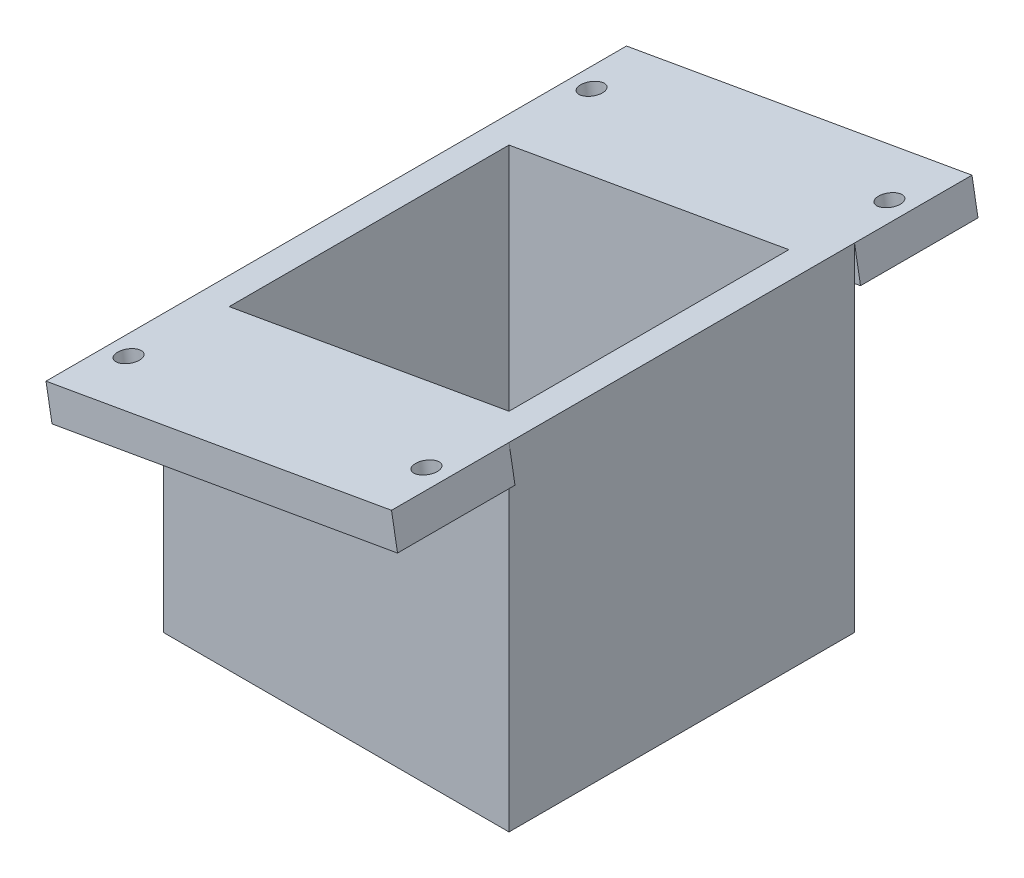
ISO-10303-21;
HEADER;
FILE_DESCRIPTION(('STEP AP214'),'2;1');
FILE_NAME('part.step','',(''),(''),'','','');
FILE_SCHEMA(('AUTOMOTIVE_DESIGN { 1 0 10303 214 1 1 1 1 }'));
ENDSEC;
DATA;
#1=APPLICATION_CONTEXT('core data for automotive mechanical design processes');
#2=APPLICATION_PROTOCOL_DEFINITION('international standard','automotive_design',2000,#1);
#3=PRODUCT_CONTEXT('',#1,'mechanical');
#4=PRODUCT('Part','Part','',(#3));
#5=PRODUCT_RELATED_PRODUCT_CATEGORY('part','',(#4));
#6=PRODUCT_DEFINITION_FORMATION('','',#4);
#7=PRODUCT_DEFINITION_CONTEXT('part definition',#1,'design');
#8=PRODUCT_DEFINITION('design','',#6,#7);
#9=PRODUCT_DEFINITION_SHAPE('','',#8);
#10=(LENGTH_UNIT() NAMED_UNIT(*) SI_UNIT(.MILLI.,.METRE.));
#11=(NAMED_UNIT(*) PLANE_ANGLE_UNIT() SI_UNIT($,.RADIAN.));
#12=(NAMED_UNIT(*) SI_UNIT($,.STERADIAN.) SOLID_ANGLE_UNIT());
#13=UNCERTAINTY_MEASURE_WITH_UNIT(LENGTH_MEASURE(1.E-05),#10,'distance_accuracy_value','');
#14=(GEOMETRIC_REPRESENTATION_CONTEXT(3) GLOBAL_UNCERTAINTY_ASSIGNED_CONTEXT((#13)) GLOBAL_UNIT_ASSIGNED_CONTEXT((#10,
#11,#12)) REPRESENTATION_CONTEXT('',''));
#15=CARTESIAN_POINT('',(0.,0.,0.));
#16=DIRECTION('',(0.,0.,1.));
#17=DIRECTION('',(1.,0.,0.));
#18=AXIS2_PLACEMENT_3D('',#15,#16,#17);
#19=CARTESIAN_POINT('',(25.,5.,-25.));
#20=DIRECTION('',(0.,0.,1.));
#21=DIRECTION('',(1.,0.,0.));
#22=AXIS2_PLACEMENT_3D('',#19,#20,#21);
#23=PLANE('',#22);
#24=DIRECTION('',(-0.17364819609251,0.984807749763281,0.));
#25=VECTOR('',#24,1.);
#26=CARTESIAN_POINT('',(-24.1317590195375,35.0759612511836,-25.));
#27=LINE('',#26,#25);
#28=CARTESIAN_POINT('',(-24.1317590195375,35.0759612511836,-25.));
#29=VERTEX_POINT('',#28);
#30=CARTESIAN_POINT('',(-25.,40.,-25.));
#31=VERTEX_POINT('',#30);
#32=EDGE_CURVE('E364',#29,#31,#27,.T.);
#33=ORIENTED_EDGE('',*,*,#32,.F.);
#34=DIRECTION('',(0.984807749763281,0.17364819609251,0.));
#35=VECTOR('',#34,1.);
#36=CARTESIAN_POINT('',(-24.1317590195375,35.0759612511836,-25.));
#37=LINE('',#36,#35);
#38=CARTESIAN_POINT('',(25.,43.7392169238216,-25.));
#39=VERTEX_POINT('',#38);
#40=EDGE_CURVE('E358',#29,#39,#37,.T.);
#41=ORIENTED_EDGE('',*,*,#40,.T.);
#42=DIRECTION('',(0.,-1.,0.));
#43=VECTOR('',#42,1.);
#44=CARTESIAN_POINT('',(25.,5.,-25.));
#45=LINE('',#44,#43);
#46=CARTESIAN_POINT('',(25.,0.,-25.));
#47=VERTEX_POINT('',#46);
#48=EDGE_CURVE('E286',#39,#47,#45,.T.);
#49=ORIENTED_EDGE('',*,*,#48,.T.);
#50=DIRECTION('',(-1.,0.,0.));
#51=VECTOR('',#50,1.);
#52=CARTESIAN_POINT('',(25.,0.,-25.));
#53=LINE('',#52,#51);
#54=CARTESIAN_POINT('',(-25.,0.,-25.));
#55=VERTEX_POINT('',#54);
#56=EDGE_CURVE('E281',#47,#55,#53,.T.);
#57=ORIENTED_EDGE('',*,*,#56,.T.);
#58=DIRECTION('',(0.,-1.,0.));
#59=VECTOR('',#58,1.);
#60=CARTESIAN_POINT('',(-25.,5.,-25.));
#61=LINE('',#60,#59);
#62=EDGE_CURVE('E283',#31,#55,#61,.T.);
#63=ORIENTED_EDGE('',*,*,#62,.F.);
#64=EDGE_LOOP('',(#33,#41,#49,#57,#63));
#65=FACE_BOUND('',#64,.T.);
#66=ADVANCED_FACE('F39',(#65),#23,.F.);
#67=CARTESIAN_POINT('',(0.,5.,0.));
#68=DIRECTION('',(0.,-1.,0.));
#69=DIRECTION('',(0.,0.,-1.));
#70=AXIS2_PLACEMENT_3D('',#67,#68,#69);
#71=PLANE('',#70);
#72=DIRECTION('',(0.,0.,-1.));
#73=VECTOR('',#72,1.);
#74=CARTESIAN_POINT('',(20.25,5.,0.));
#75=LINE('',#74,#73);
#76=CARTESIAN_POINT('',(20.25,5.,20.25));
#77=VERTEX_POINT('',#76);
#78=CARTESIAN_POINT('',(20.25,5.,-20.25));
#79=VERTEX_POINT('',#78);
#80=EDGE_CURVE('E236',#77,#79,#75,.T.);
#81=ORIENTED_EDGE('',*,*,#80,.T.);
#82=DIRECTION('',(-1.,0.,0.));
#83=VECTOR('',#82,1.);
#84=CARTESIAN_POINT('',(0.,5.,-20.25));
#85=LINE('',#84,#83);
#86=CARTESIAN_POINT('',(-20.25,5.,-20.25));
#87=VERTEX_POINT('',#86);
#88=EDGE_CURVE('E239',#79,#87,#85,.T.);
#89=ORIENTED_EDGE('',*,*,#88,.T.);
#90=DIRECTION('',(0.,0.,1.));
#91=VECTOR('',#90,1.);
#92=CARTESIAN_POINT('',(-20.25,5.,0.));
#93=LINE('',#92,#91);
#94=CARTESIAN_POINT('',(-20.25,5.,20.25));
#95=VERTEX_POINT('',#94);
#96=EDGE_CURVE('E230',#87,#95,#93,.T.);
#97=ORIENTED_EDGE('',*,*,#96,.T.);
#98=DIRECTION('',(1.,0.,0.));
#99=VECTOR('',#98,1.);
#100=CARTESIAN_POINT('',(0.,5.,20.25));
#101=LINE('',#100,#99);
#102=EDGE_CURVE('E233',#95,#77,#101,.T.);
#103=ORIENTED_EDGE('',*,*,#102,.T.);
#104=EDGE_LOOP('',(#81,#89,#97,#103));
#105=FACE_BOUND('',#104,.T.);
#106=DIRECTION('',(0.,0.,1.));
#107=VECTOR('',#106,1.);
#108=CARTESIAN_POINT('',(-18.25,5.,-18.25));
#109=LINE('',#108,#107);
#110=CARTESIAN_POINT('',(-18.25,5.,-18.25));
#111=VERTEX_POINT('',#110);
#112=CARTESIAN_POINT('',(-18.25,5.,18.25));
#113=VERTEX_POINT('',#112);
#114=EDGE_CURVE('E243',#111,#113,#109,.T.);
#115=ORIENTED_EDGE('',*,*,#114,.F.);
#116=DIRECTION('',(-1.,0.,0.));
#117=VECTOR('',#116,1.);
#118=CARTESIAN_POINT('',(18.25,5.,-18.25));
#119=LINE('',#118,#117);
#120=CARTESIAN_POINT('',(18.25,5.,-18.25));
#121=VERTEX_POINT('',#120);
#122=EDGE_CURVE('E251',#121,#111,#119,.T.);
#123=ORIENTED_EDGE('',*,*,#122,.F.);
#124=DIRECTION('',(0.,0.,-1.));
#125=VECTOR('',#124,1.);
#126=CARTESIAN_POINT('',(18.25,5.,-18.25));
#127=LINE('',#126,#125);
#128=CARTESIAN_POINT('',(18.25,5.,18.25));
#129=VERTEX_POINT('',#128);
#130=EDGE_CURVE('E248',#129,#121,#127,.T.);
#131=ORIENTED_EDGE('',*,*,#130,.F.);
#132=DIRECTION('',(1.,0.,0.));
#133=VECTOR('',#132,1.);
#134=CARTESIAN_POINT('',(18.25,5.,18.25));
#135=LINE('',#134,#133);
#136=EDGE_CURVE('E245',#113,#129,#135,.T.);
#137=ORIENTED_EDGE('',*,*,#136,.F.);
#138=EDGE_LOOP('',(#115,#123,#131,#137));
#139=FACE_BOUND('',#138,.T.);
#140=ADVANCED_FACE('F319',(#105,#139),#71,.F.);
#141=CARTESIAN_POINT('',(0.,0.,0.));
#142=DIRECTION('',(0.,-1.,0.));
#143=DIRECTION('',(0.,0.,-1.));
#144=AXIS2_PLACEMENT_3D('',#141,#142,#143);
#145=PLANE('',#144);
#146=DIRECTION('',(-1.,0.,0.));
#147=VECTOR('',#146,1.);
#148=CARTESIAN_POINT('',(18.25,0.,-18.25));
#149=LINE('',#148,#147);
#150=CARTESIAN_POINT('',(18.25,0.,-18.25));
#151=VERTEX_POINT('',#150);
#152=CARTESIAN_POINT('',(-18.25,0.,-18.25));
#153=VERTEX_POINT('',#152);
#154=EDGE_CURVE('E246',#151,#153,#149,.T.);
#155=ORIENTED_EDGE('',*,*,#154,.T.);
#156=DIRECTION('',(0.,0.,1.));
#157=VECTOR('',#156,1.);
#158=CARTESIAN_POINT('',(-18.25,0.,-18.25));
#159=LINE('',#158,#157);
#160=CARTESIAN_POINT('',(-18.25,0.,18.25));
#161=VERTEX_POINT('',#160);
#162=EDGE_CURVE('E242',#153,#161,#159,.T.);
#163=ORIENTED_EDGE('',*,*,#162,.T.);
#164=DIRECTION('',(1.,0.,0.));
#165=VECTOR('',#164,1.);
#166=CARTESIAN_POINT('',(18.25,0.,18.25));
#167=LINE('',#166,#165);
#168=CARTESIAN_POINT('',(18.25,0.,18.25));
#169=VERTEX_POINT('',#168);
#170=EDGE_CURVE('E256',#161,#169,#167,.T.);
#171=ORIENTED_EDGE('',*,*,#170,.T.);
#172=DIRECTION('',(0.,0.,-1.));
#173=VECTOR('',#172,1.);
#174=CARTESIAN_POINT('',(18.25,0.,-18.25));
#175=LINE('',#174,#173);
#176=EDGE_CURVE('E259',#169,#151,#175,.T.);
#177=ORIENTED_EDGE('',*,*,#176,.T.);
#178=EDGE_LOOP('',(#155,#163,#171,#177));
#179=FACE_BOUND('',#178,.T.);
#180=DIRECTION('',(0.,0.,1.));
#181=VECTOR('',#180,1.);
#182=CARTESIAN_POINT('',(-25.,0.,-25.));
#183=LINE('',#182,#181);
#184=CARTESIAN_POINT('',(-25.,0.,25.));
#185=VERTEX_POINT('',#184);
#186=EDGE_CURVE('E273',#55,#185,#183,.T.);
#187=ORIENTED_EDGE('',*,*,#186,.F.);
#188=ORIENTED_EDGE('',*,*,#56,.F.);
#189=DIRECTION('',(0.,0.,-1.));
#190=VECTOR('',#189,1.);
#191=CARTESIAN_POINT('',(25.,0.,-25.));
#192=LINE('',#191,#190);
#193=CARTESIAN_POINT('',(25.,0.,25.));
#194=VERTEX_POINT('',#193);
#195=EDGE_CURVE('E279',#194,#47,#192,.T.);
#196=ORIENTED_EDGE('',*,*,#195,.F.);
#197=DIRECTION('',(1.,0.,0.));
#198=VECTOR('',#197,1.);
#199=CARTESIAN_POINT('',(25.,0.,25.));
#200=LINE('',#199,#198);
#201=EDGE_CURVE('E276',#185,#194,#200,.T.);
#202=ORIENTED_EDGE('',*,*,#201,.F.);
#203=EDGE_LOOP('',(#187,#188,#196,#202));
#204=FACE_BOUND('',#203,.T.);
#205=ADVANCED_FACE('F325',(#179,#204),#145,.T.);
#206=CARTESIAN_POINT('',(-25.,5.,-25.));
#207=DIRECTION('',(1.,0.,0.));
#208=DIRECTION('',(0.,0.,-1.));
#209=AXIS2_PLACEMENT_3D('',#206,#207,#208);
#210=PLANE('',#209);
#211=ORIENTED_EDGE('',*,*,#186,.T.);
#212=DIRECTION('',(0.,-1.,0.));
#213=VECTOR('',#212,1.);
#214=CARTESIAN_POINT('',(-25.,5.,25.));
#215=LINE('',#214,#213);
#216=CARTESIAN_POINT('',(-25.,40.,25.));
#217=VERTEX_POINT('',#216);
#218=EDGE_CURVE('E48',#217,#185,#215,.T.);
#219=ORIENTED_EDGE('',*,*,#218,.F.);
#220=DIRECTION('',(0.,0.,1.));
#221=VECTOR('',#220,1.);
#222=CARTESIAN_POINT('',(-25.,40.,25.));
#223=LINE('',#222,#221);
#224=EDGE_CURVE('E212',#31,#217,#223,.T.);
#225=ORIENTED_EDGE('',*,*,#224,.F.);
#226=ORIENTED_EDGE('',*,*,#62,.T.);
#227=EDGE_LOOP('',(#211,#219,#225,#226));
#228=FACE_BOUND('',#227,.T.);
#229=ADVANCED_FACE('F41',(#228),#210,.F.);
#230=CARTESIAN_POINT('',(25.,5.,25.));
#231=DIRECTION('',(0.,0.,-1.));
#232=DIRECTION('',(-1.,0.,0.));
#233=AXIS2_PLACEMENT_3D('',#230,#231,#232);
#234=PLANE('',#233);
#235=DIRECTION('',(0.,-1.,0.));
#236=VECTOR('',#235,1.);
#237=CARTESIAN_POINT('',(25.,5.,25.));
#238=LINE('',#237,#236);
#239=CARTESIAN_POINT('',(25.,43.7392169238216,25.));
#240=VERTEX_POINT('',#239);
#241=EDGE_CURVE('E181',#240,#194,#238,.T.);
#242=ORIENTED_EDGE('',*,*,#241,.F.);
#243=DIRECTION('',(-0.984807749763281,-0.17364819609251,0.));
#244=VECTOR('',#243,1.);
#245=CARTESIAN_POINT('',(-24.1317590195375,35.0759612511836,25.));
#246=LINE('',#245,#244);
#247=CARTESIAN_POINT('',(-24.1317590195375,35.0759612511836,25.));
#248=VERTEX_POINT('',#247);
#249=EDGE_CURVE('E11',#240,#248,#246,.T.);
#250=ORIENTED_EDGE('',*,*,#249,.T.);
#251=DIRECTION('',(-0.17364819609251,0.984807749763281,0.));
#252=VECTOR('',#251,1.);
#253=CARTESIAN_POINT('',(-24.1317590195375,35.0759612511836,25.));
#254=LINE('',#253,#252);
#255=EDGE_CURVE('E745',#248,#217,#254,.T.);
#256=ORIENTED_EDGE('',*,*,#255,.T.);
#257=ORIENTED_EDGE('',*,*,#218,.T.);
#258=ORIENTED_EDGE('',*,*,#201,.T.);
#259=EDGE_LOOP('',(#242,#250,#256,#257,#258));
#260=FACE_BOUND('',#259,.T.);
#261=ADVANCED_FACE('F333',(#260),#234,.F.);
#262=CARTESIAN_POINT('',(25.,5.,-25.));
#263=DIRECTION('',(-1.,0.,0.));
#264=DIRECTION('',(0.,0.,1.));
#265=AXIS2_PLACEMENT_3D('',#262,#263,#264);
#266=PLANE('',#265);
#267=ORIENTED_EDGE('',*,*,#195,.T.);
#268=ORIENTED_EDGE('',*,*,#48,.F.);
#269=CARTESIAN_POINT('',(25.,48.81635,-25.));
#270=VERTEX_POINT('',#269);
#271=EDGE_CURVE('E207',#270,#39,#45,.T.);
#272=ORIENTED_EDGE('',*,*,#271,.F.);
#273=DIRECTION('',(0.,0.,-1.));
#274=VECTOR('',#273,1.);
#275=CARTESIAN_POINT('',(25.,48.81635,25.));
#276=LINE('',#275,#274);
#277=CARTESIAN_POINT('',(25.,48.81635,25.));
#278=VERTEX_POINT('',#277);
#279=EDGE_CURVE('E198',#278,#270,#276,.T.);
#280=ORIENTED_EDGE('',*,*,#279,.F.);
#281=EDGE_CURVE('E173',#278,#240,#238,.T.);
#282=ORIENTED_EDGE('',*,*,#281,.T.);
#283=ORIENTED_EDGE('',*,*,#241,.T.);
#284=EDGE_LOOP('',(#267,#268,#272,#280,#282,#283));
#285=FACE_BOUND('',#284,.T.);
#286=ADVANCED_FACE('F205',(#285),#266,.F.);
#287=CARTESIAN_POINT('',(-18.25,5.,-18.25));
#288=DIRECTION('',(1.,0.,0.));
#289=DIRECTION('',(0.,0.,-1.));
#290=AXIS2_PLACEMENT_3D('',#287,#288,#289);
#291=PLANE('',#290);
#292=ORIENTED_EDGE('',*,*,#162,.F.);
#293=DIRECTION('',(0.,-1.,0.));
#294=VECTOR('',#293,1.);
#295=CARTESIAN_POINT('',(-18.25,5.,-18.25));
#296=LINE('',#295,#294);
#297=EDGE_CURVE('E253',#111,#153,#296,.T.);
#298=ORIENTED_EDGE('',*,*,#297,.F.);
#299=ORIENTED_EDGE('',*,*,#114,.T.);
#300=DIRECTION('',(0.,-1.,0.));
#301=VECTOR('',#300,1.);
#302=CARTESIAN_POINT('',(-18.25,5.,18.25));
#303=LINE('',#302,#301);
#304=EDGE_CURVE('E270',#113,#161,#303,.T.);
#305=ORIENTED_EDGE('',*,*,#304,.T.);
#306=EDGE_LOOP('',(#292,#298,#299,#305));
#307=FACE_BOUND('',#306,.T.);
#308=ADVANCED_FACE('F332',(#307),#291,.T.);
#309=CARTESIAN_POINT('',(18.25,5.,18.25));
#310=DIRECTION('',(0.,0.,-1.));
#311=DIRECTION('',(-1.,0.,0.));
#312=AXIS2_PLACEMENT_3D('',#309,#310,#311);
#313=PLANE('',#312);
#314=ORIENTED_EDGE('',*,*,#170,.F.);
#315=ORIENTED_EDGE('',*,*,#304,.F.);
#316=ORIENTED_EDGE('',*,*,#136,.T.);
#317=DIRECTION('',(0.,-1.,0.));
#318=VECTOR('',#317,1.);
#319=CARTESIAN_POINT('',(18.25,5.,18.25));
#320=LINE('',#319,#318);
#321=EDGE_CURVE('E268',#129,#169,#320,.T.);
#322=ORIENTED_EDGE('',*,*,#321,.T.);
#323=EDGE_LOOP('',(#314,#315,#316,#322));
#324=FACE_BOUND('',#323,.T.);
#325=ADVANCED_FACE('F408',(#324),#313,.T.);
#326=CARTESIAN_POINT('',(18.25,5.,-18.25));
#327=DIRECTION('',(-1.,0.,0.));
#328=DIRECTION('',(0.,0.,1.));
#329=AXIS2_PLACEMENT_3D('',#326,#327,#328);
#330=PLANE('',#329);
#331=ORIENTED_EDGE('',*,*,#176,.F.);
#332=ORIENTED_EDGE('',*,*,#321,.F.);
#333=ORIENTED_EDGE('',*,*,#130,.T.);
#334=DIRECTION('',(0.,-1.,0.));
#335=VECTOR('',#334,1.);
#336=CARTESIAN_POINT('',(18.25,5.,-18.25));
#337=LINE('',#336,#335);
#338=EDGE_CURVE('E266',#121,#151,#337,.T.);
#339=ORIENTED_EDGE('',*,*,#338,.T.);
#340=EDGE_LOOP('',(#331,#332,#333,#339));
#341=FACE_BOUND('',#340,.T.);
#342=ADVANCED_FACE('F404',(#341),#330,.T.);
#343=CARTESIAN_POINT('',(18.25,5.,-18.25));
#344=DIRECTION('',(0.,0.,1.));
#345=DIRECTION('',(1.,0.,0.));
#346=AXIS2_PLACEMENT_3D('',#343,#344,#345);
#347=PLANE('',#346);
#348=ORIENTED_EDGE('',*,*,#154,.F.);
#349=ORIENTED_EDGE('',*,*,#338,.F.);
#350=ORIENTED_EDGE('',*,*,#122,.T.);
#351=ORIENTED_EDGE('',*,*,#297,.T.);
#352=EDGE_LOOP('',(#348,#349,#350,#351));
#353=FACE_BOUND('',#352,.T.);
#354=ADVANCED_FACE('F396',(#353),#347,.T.);
#355=CARTESIAN_POINT('',(20.25,110.710678118655,-20.25));
#356=DIRECTION('',(0.,0.,1.));
#357=DIRECTION('',(1.,0.,0.));
#358=AXIS2_PLACEMENT_3D('',#355,#356,#357);
#359=PLANE('',#358);
#360=ORIENTED_EDGE('',*,*,#88,.F.);
#361=DIRECTION('',(0.,-1.,0.));
#362=VECTOR('',#361,1.);
#363=CARTESIAN_POINT('',(20.25,110.710678118655,-20.25));
#364=LINE('',#363,#362);
#365=CARTESIAN_POINT('',(20.25,47.97879675,-20.25));
#366=VERTEX_POINT('',#365);
#367=EDGE_CURVE('E223',#366,#79,#364,.T.);
#368=ORIENTED_EDGE('',*,*,#367,.F.);
#369=DIRECTION('',(-0.984807749763281,-0.17364819609251,0.));
#370=VECTOR('',#369,1.);
#371=CARTESIAN_POINT('',(31.8248981935647,50.0197638237767,-20.25));
#372=LINE('',#371,#370);
#373=CARTESIAN_POINT('',(-20.25,40.83755325,-20.25));
#374=VERTEX_POINT('',#373);
#375=EDGE_CURVE('E208',#366,#374,#372,.T.);
#376=ORIENTED_EDGE('',*,*,#375,.T.);
#377=DIRECTION('',(0.,-1.,0.));
#378=VECTOR('',#377,1.);
#379=CARTESIAN_POINT('',(-20.25,110.710678118655,-20.25));
#380=LINE('',#379,#378);
#381=EDGE_CURVE('E220',#374,#87,#380,.T.);
#382=ORIENTED_EDGE('',*,*,#381,.T.);
#383=EDGE_LOOP('',(#360,#368,#376,#382));
#384=FACE_BOUND('',#383,.T.);
#385=ADVANCED_FACE('F385',(#384),#359,.T.);
#386=CARTESIAN_POINT('',(20.25,110.710678118655,20.25));
#387=DIRECTION('',(-1.,0.,0.));
#388=DIRECTION('',(0.,0.,1.));
#389=AXIS2_PLACEMENT_3D('',#386,#387,#388);
#390=PLANE('',#389);
#391=ORIENTED_EDGE('',*,*,#80,.F.);
#392=DIRECTION('',(0.,-1.,0.));
#393=VECTOR('',#392,1.);
#394=CARTESIAN_POINT('',(20.25,110.710678118655,20.25));
#395=LINE('',#394,#393);
#396=CARTESIAN_POINT('',(20.25,47.97879675,20.25));
#397=VERTEX_POINT('',#396);
#398=EDGE_CURVE('E226',#397,#77,#395,.T.);
#399=ORIENTED_EDGE('',*,*,#398,.F.);
#400=DIRECTION('',(0.,0.,-1.));
#401=VECTOR('',#400,1.);
#402=CARTESIAN_POINT('',(20.25,47.97879675,20.25));
#403=LINE('',#402,#401);
#404=EDGE_CURVE('E366',#397,#366,#403,.T.);
#405=ORIENTED_EDGE('',*,*,#404,.T.);
#406=ORIENTED_EDGE('',*,*,#367,.T.);
#407=EDGE_LOOP('',(#391,#399,#405,#406));
#408=FACE_BOUND('',#407,.T.);
#409=ADVANCED_FACE('F388',(#408),#390,.T.);
#410=CARTESIAN_POINT('',(20.25,110.710678118655,20.25));
#411=DIRECTION('',(0.,0.,-1.));
#412=DIRECTION('',(-1.,0.,0.));
#413=AXIS2_PLACEMENT_3D('',#410,#411,#412);
#414=PLANE('',#413);
#415=ORIENTED_EDGE('',*,*,#102,.F.);
#416=DIRECTION('',(0.,-1.,0.));
#417=VECTOR('',#416,1.);
#418=CARTESIAN_POINT('',(-20.25,110.710678118655,20.25));
#419=LINE('',#418,#417);
#420=CARTESIAN_POINT('',(-20.25,40.83755325,20.25));
#421=VERTEX_POINT('',#420);
#422=EDGE_CURVE('E65',#421,#95,#419,.T.);
#423=ORIENTED_EDGE('',*,*,#422,.F.);
#424=DIRECTION('',(0.984807749763281,0.17364819609251,0.));
#425=VECTOR('',#424,1.);
#426=CARTESIAN_POINT('',(31.8248981935647,50.0197638237767,20.25));
#427=LINE('',#426,#425);
#428=EDGE_CURVE('E214',#421,#397,#427,.T.);
#429=ORIENTED_EDGE('',*,*,#428,.T.);
#430=ORIENTED_EDGE('',*,*,#398,.T.);
#431=EDGE_LOOP('',(#415,#423,#429,#430));
#432=FACE_BOUND('',#431,.T.);
#433=ADVANCED_FACE('F378',(#432),#414,.T.);
#434=CARTESIAN_POINT('',(-20.25,110.710678118655,20.25));
#435=DIRECTION('',(1.,0.,0.));
#436=DIRECTION('',(0.,0.,-1.));
#437=AXIS2_PLACEMENT_3D('',#434,#435,#436);
#438=PLANE('',#437);
#439=ORIENTED_EDGE('',*,*,#96,.F.);
#440=ORIENTED_EDGE('',*,*,#381,.F.);
#441=DIRECTION('',(0.,0.,1.));
#442=VECTOR('',#441,1.);
#443=CARTESIAN_POINT('',(-20.25,40.83755325,20.25));
#444=LINE('',#443,#442);
#445=EDGE_CURVE('E209',#374,#421,#444,.T.);
#446=ORIENTED_EDGE('',*,*,#445,.T.);
#447=ORIENTED_EDGE('',*,*,#422,.T.);
#448=EDGE_LOOP('',(#439,#440,#446,#447));
#449=FACE_BOUND('',#448,.T.);
#450=ADVANCED_FACE('F383',(#449),#438,.T.);
#451=CARTESIAN_POINT('',(-7.59424596992729,43.0691043908606,0.));
#452=DIRECTION('',(-0.17364819609251,0.984807749763281,0.));
#453=DIRECTION('',(-0.984807749763281,-0.17364819609251,0.));
#454=AXIS2_PLACEMENT_3D('',#451,#452,#453);
#455=PLANE('',#454);
#456=CARTESIAN_POINT('',(-21.5531728758285,40.6077686863238,-33.5));
#457=DIRECTION('',(-0.17364819609251,0.984807749763281,0.));
#458=DIRECTION('',(0.984807749763281,0.17364819609251,0.));
#459=AXIS2_PLACEMENT_3D('',#456,#457,#458);
#460=CIRCLE('',#459,1.60000000000001);
#461=CARTESIAN_POINT('',(-19.9774804762073,40.8856058000718,-33.5));
#462=VERTEX_POINT('',#461);
#463=EDGE_CURVE('E741',#462,#462,#460,.T.);
#464=ORIENTED_EDGE('',*,*,#463,.F.);
#465=EDGE_LOOP('',(#464));
#466=FACE_BOUND('',#465,.T.);
#467=CARTESIAN_POINT('',(21.5531728758285,48.2085813136762,-33.5));
#468=DIRECTION('',(-0.17364819609251,0.984807749763281,0.));
#469=DIRECTION('',(-0.984807749763281,-0.17364819609251,0.));
#470=AXIS2_PLACEMENT_3D('',#467,#468,#469);
#471=CIRCLE('',#470,1.6);
#472=CARTESIAN_POINT('',(19.9774804762072,47.9307441999282,-33.5));
#473=VERTEX_POINT('',#472);
#474=EDGE_CURVE('E736',#473,#473,#471,.T.);
#475=ORIENTED_EDGE('',*,*,#474,.F.);
#476=EDGE_LOOP('',(#475));
#477=FACE_BOUND('',#476,.T.);
#478=CARTESIAN_POINT('',(21.5531728758285,48.2085813136762,33.5));
#479=DIRECTION('',(-0.17364819609251,0.984807749763281,0.));
#480=DIRECTION('',(0.984807749763281,0.17364819609251,0.));
#481=AXIS2_PLACEMENT_3D('',#478,#479,#480);
#482=CIRCLE('',#481,1.6);
#483=CARTESIAN_POINT('',(23.1288652754498,48.4864184274242,33.5));
#484=VERTEX_POINT('',#483);
#485=EDGE_CURVE('E734',#484,#484,#482,.T.);
#486=ORIENTED_EDGE('',*,*,#485,.F.);
#487=EDGE_LOOP('',(#486));
#488=FACE_BOUND('',#487,.T.);
#489=CARTESIAN_POINT('',(-21.5531728758285,40.6077686863238,33.5));
#490=DIRECTION('',(-0.17364819609251,0.984807749763281,0.));
#491=DIRECTION('',(-0.984807749763281,-0.17364819609251,0.));
#492=AXIS2_PLACEMENT_3D('',#489,#490,#491);
#493=CIRCLE('',#492,1.60000000000001);
#494=CARTESIAN_POINT('',(-23.1288652754498,40.3299315725758,33.5));
#495=VERTEX_POINT('',#494);
#496=EDGE_CURVE('E294',#495,#495,#493,.T.);
#497=ORIENTED_EDGE('',*,*,#496,.F.);
#498=EDGE_LOOP('',(#497));
#499=FACE_BOUND('',#498,.T.);
#500=ORIENTED_EDGE('',*,*,#445,.F.);
#501=ORIENTED_EDGE('',*,*,#375,.F.);
#502=ORIENTED_EDGE('',*,*,#404,.F.);
#503=ORIENTED_EDGE('',*,*,#428,.F.);
#504=EDGE_LOOP('',(#500,#501,#502,#503));
#505=FACE_BOUND('',#504,.T.);
#506=ORIENTED_EDGE('',*,*,#279,.T.);
#507=DIRECTION('',(0.,0.,-1.));
#508=VECTOR('',#507,1.);
#509=CARTESIAN_POINT('',(25.,48.81635,-25.));
#510=LINE('',#509,#508);
#511=CARTESIAN_POINT('',(25.,48.81635,-42.));
#512=VERTEX_POINT('',#511);
#513=EDGE_CURVE('E360',#270,#512,#510,.T.);
#514=ORIENTED_EDGE('',*,*,#513,.T.);
#515=DIRECTION('',(-0.984807749763281,-0.17364819609251,0.));
#516=VECTOR('',#515,1.);
#517=CARTESIAN_POINT('',(-25.,40.,-42.));
#518=LINE('',#517,#516);
#519=CARTESIAN_POINT('',(-25.,40.,-42.));
#520=VERTEX_POINT('',#519);
#521=EDGE_CURVE('E355',#512,#520,#518,.T.);
#522=ORIENTED_EDGE('',*,*,#521,.T.);
#523=DIRECTION('',(0.,0.,1.));
#524=VECTOR('',#523,1.);
#525=CARTESIAN_POINT('',(-25.,40.,-25.));
#526=LINE('',#525,#524);
#527=EDGE_CURVE('E353',#520,#31,#526,.T.);
#528=ORIENTED_EDGE('',*,*,#527,.T.);
#529=ORIENTED_EDGE('',*,*,#224,.T.);
#530=DIRECTION('',(0.,0.,1.));
#531=VECTOR('',#530,1.);
#532=CARTESIAN_POINT('',(-25.,40.,25.));
#533=LINE('',#532,#531);
#534=CARTESIAN_POINT('',(-25.,40.,42.));
#535=VERTEX_POINT('',#534);
#536=EDGE_CURVE('E350',#217,#535,#533,.T.);
#537=ORIENTED_EDGE('',*,*,#536,.T.);
#538=DIRECTION('',(0.984807749763281,0.17364819609251,0.));
#539=VECTOR('',#538,1.);
#540=CARTESIAN_POINT('',(-25.,40.,42.));
#541=LINE('',#540,#539);
#542=CARTESIAN_POINT('',(25.,48.81635,42.));
#543=VERTEX_POINT('',#542);
#544=EDGE_CURVE('E201',#535,#543,#541,.T.);
#545=ORIENTED_EDGE('',*,*,#544,.T.);
#546=DIRECTION('',(0.,0.,-1.));
#547=VECTOR('',#546,1.);
#548=CARTESIAN_POINT('',(25.,48.81635,25.));
#549=LINE('',#548,#547);
#550=EDGE_CURVE('E188',#543,#278,#549,.T.);
#551=ORIENTED_EDGE('',*,*,#550,.T.);
#552=EDGE_LOOP('',(#506,#514,#522,#528,#529,#537,#545,#551));
#553=FACE_BOUND('',#552,.T.);
#554=ADVANCED_FACE('F196',(#466,#477,#488,#499,#505,#553),#455,.T.);
#555=CARTESIAN_POINT('',(-24.1317590195375,35.0759612511836,-25.));
#556=DIRECTION('',(0.,0.,1.));
#557=DIRECTION('',(1.,0.,0.));
#558=AXIS2_PLACEMENT_3D('',#555,#556,#557);
#559=PLANE('',#558);
#560=DIRECTION('',(-0.17364819609251,0.984807749763281,0.));
#561=VECTOR('',#560,1.);
#562=CARTESIAN_POINT('',(25.8682409804625,43.8923112511836,-25.));
#563=LINE('',#562,#561);
#564=CARTESIAN_POINT('',(25.8682409804625,43.8923112511836,-25.));
#565=VERTEX_POINT('',#564);
#566=EDGE_CURVE('E371',#565,#270,#563,.T.);
#567=ORIENTED_EDGE('',*,*,#566,.T.);
#568=ORIENTED_EDGE('',*,*,#271,.T.);
#569=EDGE_CURVE('E57',#39,#565,#37,.T.);
#570=ORIENTED_EDGE('',*,*,#569,.T.);
#571=EDGE_LOOP('',(#567,#568,#570));
#572=FACE_BOUND('',#571,.T.);
#573=ADVANCED_FACE('F461',(#572),#559,.T.);
#574=CARTESIAN_POINT('',(-24.1317590195375,35.0759612511836,-25.));
#575=DIRECTION('',(-0.984807749763281,-0.17364819609251,0.));
#576=DIRECTION('',(0.17364819609251,-0.984807749763281,0.));
#577=AXIS2_PLACEMENT_3D('',#574,#575,#576);
#578=PLANE('',#577);
#579=ORIENTED_EDGE('',*,*,#527,.F.);
#580=DIRECTION('',(-0.17364819609251,0.984807749763281,0.));
#581=VECTOR('',#580,1.);
#582=CARTESIAN_POINT('',(-24.1317590195375,35.0759612511836,-42.));
#583=LINE('',#582,#581);
#584=CARTESIAN_POINT('',(-24.1317590195375,35.0759612511836,-42.));
#585=VERTEX_POINT('',#584);
#586=EDGE_CURVE('E367',#585,#520,#583,.T.);
#587=ORIENTED_EDGE('',*,*,#586,.F.);
#588=DIRECTION('',(0.,0.,1.));
#589=VECTOR('',#588,1.);
#590=CARTESIAN_POINT('',(-24.1317590195375,35.0759612511836,-25.));
#591=LINE('',#590,#589);
#592=EDGE_CURVE('E373',#585,#29,#591,.T.);
#593=ORIENTED_EDGE('',*,*,#592,.T.);
#594=ORIENTED_EDGE('',*,*,#32,.T.);
#595=EDGE_LOOP('',(#579,#587,#593,#594));
#596=FACE_BOUND('',#595,.T.);
#597=ADVANCED_FACE('F466',(#596),#578,.T.);
#598=CARTESIAN_POINT('',(-24.1317590195375,35.0759612511836,-42.));
#599=DIRECTION('',(0.,0.,-1.));
#600=DIRECTION('',(0.,1.,0.));
#601=AXIS2_PLACEMENT_3D('',#598,#599,#600);
#602=PLANE('',#601);
#603=ORIENTED_EDGE('',*,*,#521,.F.);
#604=DIRECTION('',(-0.17364819609251,0.984807749763281,0.));
#605=VECTOR('',#604,1.);
#606=CARTESIAN_POINT('',(25.8682409804625,43.8923112511836,-42.));
#607=LINE('',#606,#605);
#608=CARTESIAN_POINT('',(25.8682409804625,43.8923112511836,-42.));
#609=VERTEX_POINT('',#608);
#610=EDGE_CURVE('E369',#609,#512,#607,.T.);
#611=ORIENTED_EDGE('',*,*,#610,.F.);
#612=DIRECTION('',(-0.984807749763281,-0.17364819609251,0.));
#613=VECTOR('',#612,1.);
#614=CARTESIAN_POINT('',(-24.1317590195375,35.0759612511836,-42.));
#615=LINE('',#614,#613);
#616=EDGE_CURVE('E762',#609,#585,#615,.T.);
#617=ORIENTED_EDGE('',*,*,#616,.T.);
#618=ORIENTED_EDGE('',*,*,#586,.T.);
#619=EDGE_LOOP('',(#603,#611,#617,#618));
#620=FACE_BOUND('',#619,.T.);
#621=ADVANCED_FACE('F479',(#620),#602,.T.);
#622=CARTESIAN_POINT('',(25.8682409804625,43.8923112511836,-25.));
#623=DIRECTION('',(0.984807749763281,0.17364819609251,0.));
#624=DIRECTION('',(-0.17364819609251,0.984807749763281,0.));
#625=AXIS2_PLACEMENT_3D('',#622,#623,#624);
#626=PLANE('',#625);
#627=ORIENTED_EDGE('',*,*,#513,.F.);
#628=ORIENTED_EDGE('',*,*,#566,.F.);
#629=DIRECTION('',(0.,0.,-1.));
#630=VECTOR('',#629,1.);
#631=CARTESIAN_POINT('',(25.8682409804625,43.8923112511836,-25.));
#632=LINE('',#631,#630);
#633=EDGE_CURVE('E759',#565,#609,#632,.T.);
#634=ORIENTED_EDGE('',*,*,#633,.T.);
#635=ORIENTED_EDGE('',*,*,#610,.T.);
#636=EDGE_LOOP('',(#627,#628,#634,#635));
#637=FACE_BOUND('',#636,.T.);
#638=ADVANCED_FACE('F489',(#637),#626,.T.);
#639=CARTESIAN_POINT('',(-6.72600498946474,38.1450656420443,0.));
#640=DIRECTION('',(-0.17364819609251,0.984807749763281,0.));
#641=DIRECTION('',(-0.984807749763281,-0.17364819609251,0.));
#642=AXIS2_PLACEMENT_3D('',#639,#640,#641);
#643=PLANE('',#642);
#644=CARTESIAN_POINT('',(-20.684931895366,35.6837299375074,-33.5));
#645=DIRECTION('',(-0.17364819609251,0.984807749763281,0.));
#646=DIRECTION('',(-0.984807749763281,-0.17364819609251,0.));
#647=AXIS2_PLACEMENT_3D('',#644,#645,#646);
#648=CIRCLE('',#647,1.60000000000001);
#649=CARTESIAN_POINT('',(-22.2606242949872,35.4058928237594,-33.5));
#650=VERTEX_POINT('',#649);
#651=EDGE_CURVE('E43',#650,#650,#648,.T.);
#652=ORIENTED_EDGE('',*,*,#651,.T.);
#653=EDGE_LOOP('',(#652));
#654=FACE_BOUND('',#653,.T.);
#655=CARTESIAN_POINT('',(22.421413856291,43.2845425648598,-33.5));
#656=DIRECTION('',(-0.17364819609251,0.984807749763281,0.));
#657=DIRECTION('',(-0.984807749763281,-0.17364819609251,0.));
#658=AXIS2_PLACEMENT_3D('',#655,#656,#657);
#659=CIRCLE('',#658,1.6);
#660=CARTESIAN_POINT('',(20.8457214566698,43.0067054511118,-33.5));
#661=VERTEX_POINT('',#660);
#662=EDGE_CURVE('E296',#661,#661,#659,.T.);
#663=ORIENTED_EDGE('',*,*,#662,.T.);
#664=EDGE_LOOP('',(#663));
#665=FACE_BOUND('',#664,.T.);
#666=ORIENTED_EDGE('',*,*,#40,.F.);
#667=ORIENTED_EDGE('',*,*,#592,.F.);
#668=ORIENTED_EDGE('',*,*,#616,.F.);
#669=ORIENTED_EDGE('',*,*,#633,.F.);
#670=ORIENTED_EDGE('',*,*,#569,.F.);
#671=EDGE_LOOP('',(#666,#667,#668,#669,#670));
#672=FACE_BOUND('',#671,.T.);
#673=ADVANCED_FACE('F303',(#654,#665,#672),#643,.F.);
#674=CARTESIAN_POINT('',(-24.1317590195375,35.0759612511836,25.));
#675=DIRECTION('',(0.,0.,-1.));
#676=DIRECTION('',(0.,1.,0.));
#677=AXIS2_PLACEMENT_3D('',#674,#675,#676);
#678=PLANE('',#677);
#679=ORIENTED_EDGE('',*,*,#281,.F.);
#680=DIRECTION('',(-0.17364819609251,0.984807749763281,0.));
#681=VECTOR('',#680,1.);
#682=CARTESIAN_POINT('',(25.8682409804625,43.8923112511836,25.));
#683=LINE('',#682,#681);
#684=CARTESIAN_POINT('',(25.8682409804625,43.8923112511836,25.));
#685=VERTEX_POINT('',#684);
#686=EDGE_CURVE('E176',#685,#278,#683,.T.);
#687=ORIENTED_EDGE('',*,*,#686,.F.);
#688=EDGE_CURVE('E50',#685,#240,#246,.T.);
#689=ORIENTED_EDGE('',*,*,#688,.T.);
#690=EDGE_LOOP('',(#679,#687,#689));
#691=FACE_BOUND('',#690,.T.);
#692=ADVANCED_FACE('F175',(#691),#678,.T.);
#693=CARTESIAN_POINT('',(25.8682409804625,43.8923112511836,25.));
#694=DIRECTION('',(0.984807749763281,0.17364819609251,0.));
#695=DIRECTION('',(-0.17364819609251,0.984807749763281,0.));
#696=AXIS2_PLACEMENT_3D('',#693,#694,#695);
#697=PLANE('',#696);
#698=ORIENTED_EDGE('',*,*,#550,.F.);
#699=DIRECTION('',(-0.17364819609251,0.984807749763281,0.));
#700=VECTOR('',#699,1.);
#701=CARTESIAN_POINT('',(25.8682409804625,43.8923112511836,42.));
#702=LINE('',#701,#700);
#703=CARTESIAN_POINT('',(25.8682409804625,43.8923112511836,42.));
#704=VERTEX_POINT('',#703);
#705=EDGE_CURVE('E191',#704,#543,#702,.T.);
#706=ORIENTED_EDGE('',*,*,#705,.F.);
#707=DIRECTION('',(0.,0.,-1.));
#708=VECTOR('',#707,1.);
#709=CARTESIAN_POINT('',(25.8682409804625,43.8923112511836,25.));
#710=LINE('',#709,#708);
#711=EDGE_CURVE('E190',#704,#685,#710,.T.);
#712=ORIENTED_EDGE('',*,*,#711,.T.);
#713=ORIENTED_EDGE('',*,*,#686,.T.);
#714=EDGE_LOOP('',(#698,#706,#712,#713));
#715=FACE_BOUND('',#714,.T.);
#716=ADVANCED_FACE('F187',(#715),#697,.T.);
#717=CARTESIAN_POINT('',(-24.1317590195375,35.0759612511836,42.));
#718=DIRECTION('',(0.,0.,1.));
#719=DIRECTION('',(0.,-1.,0.));
#720=AXIS2_PLACEMENT_3D('',#717,#718,#719);
#721=PLANE('',#720);
#722=ORIENTED_EDGE('',*,*,#544,.F.);
#723=DIRECTION('',(-0.17364819609251,0.984807749763281,0.));
#724=VECTOR('',#723,1.);
#725=CARTESIAN_POINT('',(-24.1317590195375,35.0759612511836,42.));
#726=LINE('',#725,#724);
#727=CARTESIAN_POINT('',(-24.1317590195375,35.0759612511836,42.));
#728=VERTEX_POINT('',#727);
#729=EDGE_CURVE('E747',#728,#535,#726,.T.);
#730=ORIENTED_EDGE('',*,*,#729,.F.);
#731=DIRECTION('',(0.984807749763281,0.17364819609251,0.));
#732=VECTOR('',#731,1.);
#733=CARTESIAN_POINT('',(-24.1317590195375,35.0759612511836,42.));
#734=LINE('',#733,#732);
#735=EDGE_CURVE('E753',#728,#704,#734,.T.);
#736=ORIENTED_EDGE('',*,*,#735,.T.);
#737=ORIENTED_EDGE('',*,*,#705,.T.);
#738=EDGE_LOOP('',(#722,#730,#736,#737));
#739=FACE_BOUND('',#738,.T.);
#740=ADVANCED_FACE('F521',(#739),#721,.T.);
#741=CARTESIAN_POINT('',(-24.1317590195375,35.0759612511836,25.));
#742=DIRECTION('',(-0.984807749763281,-0.17364819609251,0.));
#743=DIRECTION('',(0.17364819609251,-0.984807749763281,0.));
#744=AXIS2_PLACEMENT_3D('',#741,#742,#743);
#745=PLANE('',#744);
#746=ORIENTED_EDGE('',*,*,#536,.F.);
#747=ORIENTED_EDGE('',*,*,#255,.F.);
#748=DIRECTION('',(0.,0.,1.));
#749=VECTOR('',#748,1.);
#750=CARTESIAN_POINT('',(-24.1317590195375,35.0759612511836,25.));
#751=LINE('',#750,#749);
#752=EDGE_CURVE('E756',#248,#728,#751,.T.);
#753=ORIENTED_EDGE('',*,*,#752,.T.);
#754=ORIENTED_EDGE('',*,*,#729,.T.);
#755=EDGE_LOOP('',(#746,#747,#753,#754));
#756=FACE_BOUND('',#755,.T.);
#757=ADVANCED_FACE('F531',(#756),#745,.T.);
#758=CARTESIAN_POINT('',(-6.72600498946474,38.1450656420442,0.));
#759=DIRECTION('',(0.17364819609251,-0.984807749763281,0.));
#760=DIRECTION('',(0.984807749763281,0.17364819609251,0.));
#761=AXIS2_PLACEMENT_3D('',#758,#759,#760);
#762=PLANE('',#761);
#763=CARTESIAN_POINT('',(22.421413856291,43.2845425648598,33.5));
#764=DIRECTION('',(0.17364819609251,-0.984807749763281,0.));
#765=DIRECTION('',(0.984807749763281,0.17364819609251,0.));
#766=AXIS2_PLACEMENT_3D('',#763,#764,#765);
#767=CIRCLE('',#766,1.6);
#768=CARTESIAN_POINT('',(23.9971062559123,43.5623796786078,33.5));
#769=VERTEX_POINT('',#768);
#770=EDGE_CURVE('E293',#769,#769,#767,.T.);
#771=ORIENTED_EDGE('',*,*,#770,.F.);
#772=EDGE_LOOP('',(#771));
#773=FACE_BOUND('',#772,.T.);
#774=CARTESIAN_POINT('',(-20.684931895366,35.6837299375074,33.5));
#775=DIRECTION('',(0.17364819609251,-0.984807749763281,0.));
#776=DIRECTION('',(0.984807749763281,0.17364819609251,0.));
#777=AXIS2_PLACEMENT_3D('',#774,#775,#776);
#778=CIRCLE('',#777,1.60000000000001);
#779=CARTESIAN_POINT('',(-19.1092394957447,35.9615670512554,33.5));
#780=VERTEX_POINT('',#779);
#781=EDGE_CURVE('E290',#780,#780,#778,.T.);
#782=ORIENTED_EDGE('',*,*,#781,.F.);
#783=EDGE_LOOP('',(#782));
#784=FACE_BOUND('',#783,.T.);
#785=ORIENTED_EDGE('',*,*,#688,.F.);
#786=ORIENTED_EDGE('',*,*,#711,.F.);
#787=ORIENTED_EDGE('',*,*,#735,.F.);
#788=ORIENTED_EDGE('',*,*,#752,.F.);
#789=ORIENTED_EDGE('',*,*,#249,.F.);
#790=EDGE_LOOP('',(#785,#786,#787,#788,#789));
#791=FACE_BOUND('',#790,.T.);
#792=ADVANCED_FACE('F542',(#773,#784,#791),#762,.T.);
#793=CARTESIAN_POINT('',(-19.2089222285796,27.3128640645195,33.5));
#794=DIRECTION('',(-0.17364819609251,0.984807749763281,0.));
#795=DIRECTION('',(-0.984807749763281,-0.17364819609251,0.));
#796=AXIS2_PLACEMENT_3D('',#793,#794,#795);
#797=CYLINDRICAL_SURFACE('',#796,1.60000000000001);
#798=ORIENTED_EDGE('',*,*,#781,.T.);
#799=EDGE_LOOP('',(#798));
#800=FACE_BOUND('',#799,.T.);
#801=ORIENTED_EDGE('',*,*,#496,.T.);
#802=EDGE_LOOP('',(#801));
#803=FACE_BOUND('',#802,.T.);
#804=ADVANCED_FACE('F567',(#800,#803),#797,.F.);
#805=CARTESIAN_POINT('',(23.8974235230774,34.9136766918719,33.5));
#806=DIRECTION('',(-0.17364819609251,0.984807749763281,0.));
#807=DIRECTION('',(-0.984807749763281,-0.17364819609251,0.));
#808=AXIS2_PLACEMENT_3D('',#805,#806,#807);
#809=CYLINDRICAL_SURFACE('',#808,1.6);
#810=ORIENTED_EDGE('',*,*,#770,.T.);
#811=EDGE_LOOP('',(#810));
#812=FACE_BOUND('',#811,.T.);
#813=ORIENTED_EDGE('',*,*,#485,.T.);
#814=EDGE_LOOP('',(#813));
#815=FACE_BOUND('',#814,.T.);
#816=ADVANCED_FACE('F313',(#812,#815),#809,.F.);
#817=CARTESIAN_POINT('',(23.8974235230774,34.9136766918719,-33.5));
#818=DIRECTION('',(-0.17364819609251,0.984807749763281,0.));
#819=DIRECTION('',(-0.984807749763281,-0.17364819609251,0.));
#820=AXIS2_PLACEMENT_3D('',#817,#818,#819);
#821=CYLINDRICAL_SURFACE('',#820,1.6);
#822=ORIENTED_EDGE('',*,*,#474,.T.);
#823=EDGE_LOOP('',(#822));
#824=FACE_BOUND('',#823,.T.);
#825=ORIENTED_EDGE('',*,*,#662,.F.);
#826=EDGE_LOOP('',(#825));
#827=FACE_BOUND('',#826,.T.);
#828=ADVANCED_FACE('F307',(#824,#827),#821,.F.);
#829=CARTESIAN_POINT('',(-19.2089222285796,27.3128640645195,-33.5));
#830=DIRECTION('',(-0.17364819609251,0.984807749763281,0.));
#831=DIRECTION('',(-0.984807749763281,-0.17364819609251,0.));
#832=AXIS2_PLACEMENT_3D('',#829,#830,#831);
#833=CYLINDRICAL_SURFACE('',#832,1.60000000000001);
#834=ORIENTED_EDGE('',*,*,#463,.T.);
#835=EDGE_LOOP('',(#834));
#836=FACE_BOUND('',#835,.T.);
#837=ORIENTED_EDGE('',*,*,#651,.F.);
#838=EDGE_LOOP('',(#837));
#839=FACE_BOUND('',#838,.T.);
#840=ADVANCED_FACE('F305',(#836,#839),#833,.F.);
#841=CLOSED_SHELL('',(#66,#140,#205,#229,#261,#286,#308,#325,#342,#354,#385,#409,#433,#450,#554,
#573,#597,#621,#638,#673,#692,#716,#740,#757,#792,#804,#816,#828,#840));
#842=MANIFOLD_SOLID_BREP('B2',#841);
#843=ADVANCED_BREP_SHAPE_REPRESENTATION('',(#18,#842),#14);
#844=SHAPE_DEFINITION_REPRESENTATION(#9,#843);
ENDSEC;
END-ISO-10303-21;
